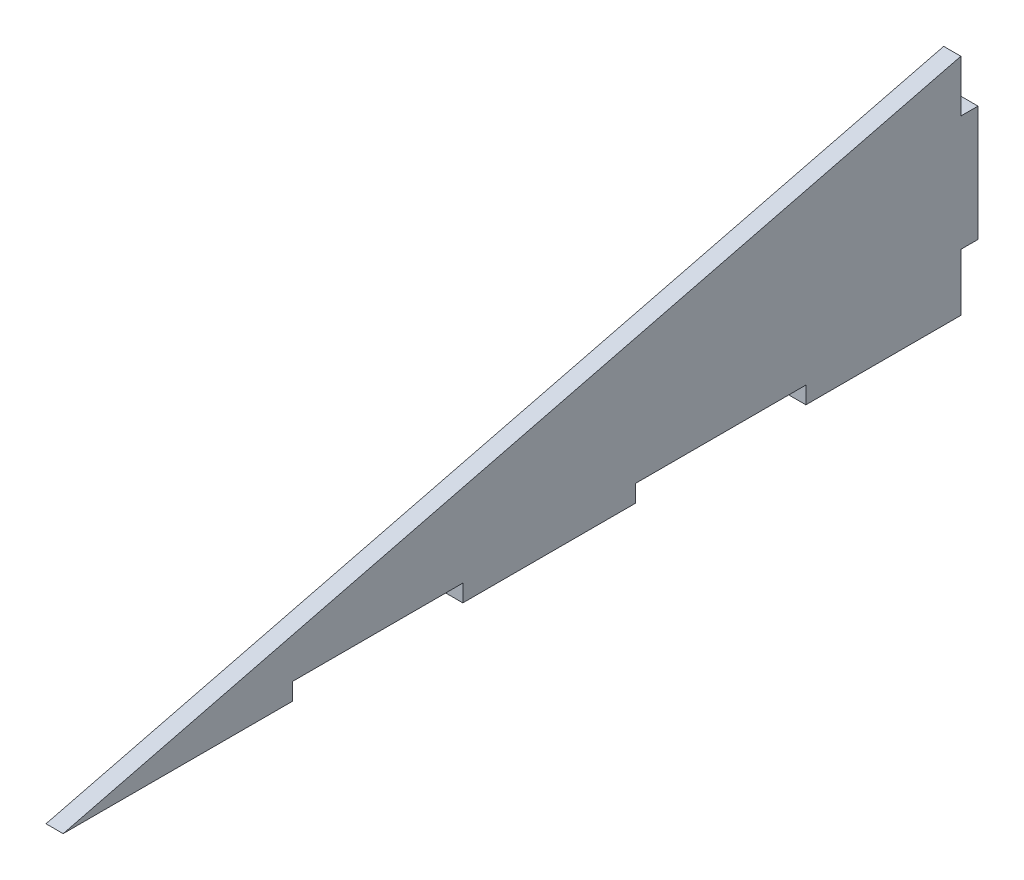
ISO-10303-21;
HEADER;
FILE_DESCRIPTION(('STEP AP214'),'2;1');
FILE_NAME('part.step','',(''),(''),'','','');
FILE_SCHEMA(('AUTOMOTIVE_DESIGN { 1 0 10303 214 1 1 1 1 }'));
ENDSEC;
DATA;
#1=APPLICATION_CONTEXT('core data for automotive mechanical design processes');
#2=APPLICATION_PROTOCOL_DEFINITION('international standard','automotive_design',2000,#1);
#3=PRODUCT_CONTEXT('',#1,'mechanical');
#4=PRODUCT('Part','Part','',(#3));
#5=PRODUCT_RELATED_PRODUCT_CATEGORY('part','',(#4));
#6=PRODUCT_DEFINITION_FORMATION('','',#4);
#7=PRODUCT_DEFINITION_CONTEXT('part definition',#1,'design');
#8=PRODUCT_DEFINITION('design','',#6,#7);
#9=PRODUCT_DEFINITION_SHAPE('','',#8);
#10=(LENGTH_UNIT() NAMED_UNIT(*) SI_UNIT(.MILLI.,.METRE.));
#11=(NAMED_UNIT(*) PLANE_ANGLE_UNIT() SI_UNIT($,.RADIAN.));
#12=(NAMED_UNIT(*) SI_UNIT($,.STERADIAN.) SOLID_ANGLE_UNIT());
#13=UNCERTAINTY_MEASURE_WITH_UNIT(LENGTH_MEASURE(1.E-05),#10,'distance_accuracy_value','');
#14=(GEOMETRIC_REPRESENTATION_CONTEXT(3) GLOBAL_UNCERTAINTY_ASSIGNED_CONTEXT((#13)) GLOBAL_UNIT_ASSIGNED_CONTEXT((#10,
#11,#12)) REPRESENTATION_CONTEXT('',''));
#15=CARTESIAN_POINT('',(0.,0.,0.));
#16=DIRECTION('',(0.,0.,1.));
#17=DIRECTION('',(1.,0.,0.));
#18=AXIS2_PLACEMENT_3D('',#15,#16,#17);
#19=CARTESIAN_POINT('',(3.,0.,-100.1));
#20=DIRECTION('',(0.,0.,1.));
#21=DIRECTION('',(1.,0.,0.));
#22=AXIS2_PLACEMENT_3D('',#19,#20,#21);
#23=PLANE('',#22);
#24=DIRECTION('',(0.,1.,0.));
#25=VECTOR('',#24,1.);
#26=CARTESIAN_POINT('',(0.,0.,-100.1));
#27=LINE('',#26,#25);
#28=CARTESIAN_POINT('',(0.,0.,-100.1));
#29=VERTEX_POINT('',#28);
#30=CARTESIAN_POINT('',(0.,3.,-100.1));
#31=VERTEX_POINT('',#30);
#32=EDGE_CURVE('E173',#29,#31,#27,.T.);
#33=ORIENTED_EDGE('',*,*,#32,.T.);
#34=DIRECTION('',(-1.,0.,0.));
#35=VECTOR('',#34,1.);
#36=CARTESIAN_POINT('',(3.,3.,-100.1));
#37=LINE('',#36,#35);
#38=CARTESIAN_POINT('',(3.,3.,-100.1));
#39=VERTEX_POINT('',#38);
#40=EDGE_CURVE('E11',#39,#31,#37,.T.);
#41=ORIENTED_EDGE('',*,*,#40,.F.);
#42=DIRECTION('',(0.,1.,0.));
#43=VECTOR('',#42,1.);
#44=CARTESIAN_POINT('',(3.,0.,-100.1));
#45=LINE('',#44,#43);
#46=CARTESIAN_POINT('',(3.,0.,-100.1));
#47=VERTEX_POINT('',#46);
#48=EDGE_CURVE('E251',#47,#39,#45,.T.);
#49=ORIENTED_EDGE('',*,*,#48,.F.);
#50=DIRECTION('',(-1.,0.,0.));
#51=VECTOR('',#50,1.);
#52=CARTESIAN_POINT('',(3.,0.,-100.1));
#53=LINE('',#52,#51);
#54=EDGE_CURVE('E167',#47,#29,#53,.T.);
#55=ORIENTED_EDGE('',*,*,#54,.T.);
#56=EDGE_LOOP('',(#33,#41,#49,#55));
#57=FACE_BOUND('',#56,.T.);
#58=ADVANCED_FACE('F34',(#57),#23,.F.);
#59=CARTESIAN_POINT('',(3.,3.,0.));
#60=DIRECTION('',(0.,1.,0.));
#61=DIRECTION('',(0.,0.,1.));
#62=AXIS2_PLACEMENT_3D('',#59,#60,#61);
#63=PLANE('',#62);
#64=DIRECTION('',(0.,0.,-1.));
#65=VECTOR('',#64,1.);
#66=CARTESIAN_POINT('',(0.,3.,0.));
#67=LINE('',#66,#65);
#68=CARTESIAN_POINT('',(0.,3.,-129.9));
#69=VERTEX_POINT('',#68);
#70=EDGE_CURVE('E176',#31,#69,#67,.T.);
#71=ORIENTED_EDGE('',*,*,#70,.T.);
#72=DIRECTION('',(-1.,0.,0.));
#73=VECTOR('',#72,1.);
#74=CARTESIAN_POINT('',(3.,3.,-129.9));
#75=LINE('',#74,#73);
#76=CARTESIAN_POINT('',(3.,3.,-129.9));
#77=VERTEX_POINT('',#76);
#78=EDGE_CURVE('E42',#77,#69,#75,.T.);
#79=ORIENTED_EDGE('',*,*,#78,.F.);
#80=DIRECTION('',(0.,0.,-1.));
#81=VECTOR('',#80,1.);
#82=CARTESIAN_POINT('',(3.,3.,0.));
#83=LINE('',#82,#81);
#84=EDGE_CURVE('E110',#39,#77,#83,.T.);
#85=ORIENTED_EDGE('',*,*,#84,.F.);
#86=ORIENTED_EDGE('',*,*,#40,.T.);
#87=EDGE_LOOP('',(#71,#79,#85,#86));
#88=FACE_BOUND('',#87,.T.);
#89=ADVANCED_FACE('F236',(#88),#63,.F.);
#90=CARTESIAN_POINT('',(3.,0.,-129.9));
#91=DIRECTION('',(0.,0.,1.));
#92=DIRECTION('',(1.,0.,0.));
#93=AXIS2_PLACEMENT_3D('',#90,#91,#92);
#94=PLANE('',#93);
#95=DIRECTION('',(0.,1.,0.));
#96=VECTOR('',#95,1.);
#97=CARTESIAN_POINT('',(0.,0.,-129.9));
#98=LINE('',#97,#96);
#99=CARTESIAN_POINT('',(0.,0.,-129.9));
#100=VERTEX_POINT('',#99);
#101=EDGE_CURVE('E179',#100,#69,#98,.T.);
#102=ORIENTED_EDGE('',*,*,#101,.F.);
#103=DIRECTION('',(-1.,0.,0.));
#104=VECTOR('',#103,1.);
#105=CARTESIAN_POINT('',(3.,0.,-129.9));
#106=LINE('',#105,#104);
#107=CARTESIAN_POINT('',(3.,0.,-129.9));
#108=VERTEX_POINT('',#107);
#109=EDGE_CURVE('E229',#108,#100,#106,.T.);
#110=ORIENTED_EDGE('',*,*,#109,.F.);
#111=DIRECTION('',(0.,1.,0.));
#112=VECTOR('',#111,1.);
#113=CARTESIAN_POINT('',(3.,0.,-129.9));
#114=LINE('',#113,#112);
#115=EDGE_CURVE('E235',#108,#77,#114,.T.);
#116=ORIENTED_EDGE('',*,*,#115,.T.);
#117=ORIENTED_EDGE('',*,*,#78,.T.);
#118=EDGE_LOOP('',(#102,#110,#116,#117));
#119=FACE_BOUND('',#118,.T.);
#120=ADVANCED_FACE('F233',(#119),#94,.T.);
#121=CARTESIAN_POINT('',(3.,0.,0.));
#122=DIRECTION('',(0.,1.,0.));
#123=DIRECTION('',(0.,0.,1.));
#124=AXIS2_PLACEMENT_3D('',#121,#122,#123);
#125=PLANE('',#124);
#126=DIRECTION('',(0.,0.,-1.));
#127=VECTOR('',#126,1.);
#128=CARTESIAN_POINT('',(0.,0.,0.));
#129=LINE('',#128,#127);
#130=CARTESIAN_POINT('',(0.,0.,-157.));
#131=VERTEX_POINT('',#130);
#132=EDGE_CURVE('E182',#100,#131,#129,.T.);
#133=ORIENTED_EDGE('',*,*,#132,.T.);
#134=DIRECTION('',(-1.,0.,0.));
#135=VECTOR('',#134,1.);
#136=CARTESIAN_POINT('',(3.,0.,-157.));
#137=LINE('',#136,#135);
#138=CARTESIAN_POINT('',(3.,0.,-157.));
#139=VERTEX_POINT('',#138);
#140=EDGE_CURVE('E227',#139,#131,#137,.T.);
#141=ORIENTED_EDGE('',*,*,#140,.F.);
#142=DIRECTION('',(0.,0.,-1.));
#143=VECTOR('',#142,1.);
#144=CARTESIAN_POINT('',(3.,0.,0.));
#145=LINE('',#144,#143);
#146=EDGE_CURVE('E170',#108,#139,#145,.T.);
#147=ORIENTED_EDGE('',*,*,#146,.F.);
#148=ORIENTED_EDGE('',*,*,#109,.T.);
#149=EDGE_LOOP('',(#133,#141,#147,#148));
#150=FACE_BOUND('',#149,.T.);
#151=ADVANCED_FACE('F245',(#150),#125,.F.);
#152=CARTESIAN_POINT('',(3.,0.,-157.));
#153=DIRECTION('',(0.,0.,-1.));
#154=DIRECTION('',(-1.,0.,0.));
#155=AXIS2_PLACEMENT_3D('',#152,#153,#154);
#156=PLANE('',#155);
#157=DIRECTION('',(0.,-1.,0.));
#158=VECTOR('',#157,1.);
#159=CARTESIAN_POINT('',(0.,0.,-157.));
#160=LINE('',#159,#158);
#161=CARTESIAN_POINT('',(0.,10.,-157.));
#162=VERTEX_POINT('',#161);
#163=EDGE_CURVE('E185',#162,#131,#160,.T.);
#164=ORIENTED_EDGE('',*,*,#163,.F.);
#165=DIRECTION('',(-1.,0.,0.));
#166=VECTOR('',#165,1.);
#167=CARTESIAN_POINT('',(3.,10.,-157.));
#168=LINE('',#167,#166);
#169=CARTESIAN_POINT('',(3.,10.,-157.));
#170=VERTEX_POINT('',#169);
#171=EDGE_CURVE('E225',#170,#162,#168,.T.);
#172=ORIENTED_EDGE('',*,*,#171,.F.);
#173=DIRECTION('',(0.,-1.,0.));
#174=VECTOR('',#173,1.);
#175=CARTESIAN_POINT('',(3.,0.,-157.));
#176=LINE('',#175,#174);
#177=EDGE_CURVE('E249',#170,#139,#176,.T.);
#178=ORIENTED_EDGE('',*,*,#177,.T.);
#179=ORIENTED_EDGE('',*,*,#140,.T.);
#180=EDGE_LOOP('',(#164,#172,#178,#179));
#181=FACE_BOUND('',#180,.T.);
#182=ADVANCED_FACE('F289',(#181),#156,.T.);
#183=CARTESIAN_POINT('',(3.,10.0000000000001,0.));
#184=DIRECTION('',(0.,-1.,0.));
#185=DIRECTION('',(0.,0.,-1.));
#186=AXIS2_PLACEMENT_3D('',#183,#184,#185);
#187=PLANE('',#186);
#188=DIRECTION('',(0.,0.,1.));
#189=VECTOR('',#188,1.);
#190=CARTESIAN_POINT('',(0.,10.0000000000001,0.));
#191=LINE('',#190,#189);
#192=CARTESIAN_POINT('',(0.,10.,-160.));
#193=VERTEX_POINT('',#192);
#194=EDGE_CURVE('E189',#193,#162,#191,.T.);
#195=ORIENTED_EDGE('',*,*,#194,.F.);
#196=DIRECTION('',(-1.,0.,0.));
#197=VECTOR('',#196,1.);
#198=CARTESIAN_POINT('',(3.,10.,-160.));
#199=LINE('',#198,#197);
#200=CARTESIAN_POINT('',(3.,10.,-160.));
#201=VERTEX_POINT('',#200);
#202=EDGE_CURVE('E223',#201,#193,#199,.T.);
#203=ORIENTED_EDGE('',*,*,#202,.F.);
#204=DIRECTION('',(0.,0.,1.));
#205=VECTOR('',#204,1.);
#206=CARTESIAN_POINT('',(3.,10.0000000000001,0.));
#207=LINE('',#206,#205);
#208=EDGE_CURVE('E256',#201,#170,#207,.T.);
#209=ORIENTED_EDGE('',*,*,#208,.T.);
#210=ORIENTED_EDGE('',*,*,#171,.T.);
#211=EDGE_LOOP('',(#195,#203,#209,#210));
#212=FACE_BOUND('',#211,.T.);
#213=ADVANCED_FACE('F303',(#212),#187,.T.);
#214=CARTESIAN_POINT('',(3.,0.,-160.));
#215=DIRECTION('',(0.,0.,1.));
#216=DIRECTION('',(1.,0.,0.));
#217=AXIS2_PLACEMENT_3D('',#214,#215,#216);
#218=PLANE('',#217);
#219=DIRECTION('',(0.,1.,0.));
#220=VECTOR('',#219,1.);
#221=CARTESIAN_POINT('',(0.,0.,-160.));
#222=LINE('',#221,#220);
#223=CARTESIAN_POINT('',(0.,30.2,-160.));
#224=VERTEX_POINT('',#223);
#225=EDGE_CURVE('E192',#193,#224,#222,.T.);
#226=ORIENTED_EDGE('',*,*,#225,.T.);
#227=DIRECTION('',(-1.,0.,0.));
#228=VECTOR('',#227,1.);
#229=CARTESIAN_POINT('',(3.,30.2,-160.));
#230=LINE('',#229,#228);
#231=CARTESIAN_POINT('',(3.,30.2,-160.));
#232=VERTEX_POINT('',#231);
#233=EDGE_CURVE('E220',#232,#224,#230,.T.);
#234=ORIENTED_EDGE('',*,*,#233,.F.);
#235=DIRECTION('',(0.,1.,0.));
#236=VECTOR('',#235,1.);
#237=CARTESIAN_POINT('',(3.,0.,-160.));
#238=LINE('',#237,#236);
#239=EDGE_CURVE('E259',#201,#232,#238,.T.);
#240=ORIENTED_EDGE('',*,*,#239,.F.);
#241=ORIENTED_EDGE('',*,*,#202,.T.);
#242=EDGE_LOOP('',(#226,#234,#240,#241));
#243=FACE_BOUND('',#242,.T.);
#244=ADVANCED_FACE('F307',(#243),#218,.F.);
#245=CARTESIAN_POINT('',(3.,30.2,0.));
#246=DIRECTION('',(0.,-1.,0.));
#247=DIRECTION('',(0.,0.,-1.));
#248=AXIS2_PLACEMENT_3D('',#245,#246,#247);
#249=PLANE('',#248);
#250=DIRECTION('',(0.,0.,1.));
#251=VECTOR('',#250,1.);
#252=CARTESIAN_POINT('',(0.,30.2,0.));
#253=LINE('',#252,#251);
#254=CARTESIAN_POINT('',(0.,30.2,-157.));
#255=VERTEX_POINT('',#254);
#256=EDGE_CURVE('E194',#224,#255,#253,.T.);
#257=ORIENTED_EDGE('',*,*,#256,.T.);
#258=DIRECTION('',(-1.,0.,0.));
#259=VECTOR('',#258,1.);
#260=CARTESIAN_POINT('',(3.,30.2,-157.));
#261=LINE('',#260,#259);
#262=CARTESIAN_POINT('',(3.,30.2,-157.));
#263=VERTEX_POINT('',#262);
#264=EDGE_CURVE('E217',#263,#255,#261,.T.);
#265=ORIENTED_EDGE('',*,*,#264,.F.);
#266=DIRECTION('',(0.,0.,1.));
#267=VECTOR('',#266,1.);
#268=CARTESIAN_POINT('',(3.,30.2,0.));
#269=LINE('',#268,#267);
#270=EDGE_CURVE('E261',#232,#263,#269,.T.);
#271=ORIENTED_EDGE('',*,*,#270,.F.);
#272=ORIENTED_EDGE('',*,*,#233,.T.);
#273=EDGE_LOOP('',(#257,#265,#271,#272));
#274=FACE_BOUND('',#273,.T.);
#275=ADVANCED_FACE('F311',(#274),#249,.F.);
#276=CARTESIAN_POINT('',(3.,4.8150556592859E-13,-157.));
#277=DIRECTION('',(0.,0.,1.));
#278=DIRECTION('',(0.,-1.,0.));
#279=AXIS2_PLACEMENT_3D('',#276,#277,#278);
#280=PLANE('',#279);
#281=DIRECTION('',(0.,1.,0.));
#282=VECTOR('',#281,1.);
#283=CARTESIAN_POINT('',(0.,4.8150556592859E-13,-157.));
#284=LINE('',#283,#282);
#285=CARTESIAN_POINT('',(0.,39.25,-157.));
#286=VERTEX_POINT('',#285);
#287=EDGE_CURVE('E196',#255,#286,#284,.T.);
#288=ORIENTED_EDGE('',*,*,#287,.T.);
#289=DIRECTION('',(-1.,0.,0.));
#290=VECTOR('',#289,1.);
#291=CARTESIAN_POINT('',(3.,39.25,-157.));
#292=LINE('',#291,#290);
#293=CARTESIAN_POINT('',(3.,39.25,-157.));
#294=VERTEX_POINT('',#293);
#295=EDGE_CURVE('E215',#294,#286,#292,.T.);
#296=ORIENTED_EDGE('',*,*,#295,.F.);
#297=DIRECTION('',(0.,1.,0.));
#298=VECTOR('',#297,1.);
#299=CARTESIAN_POINT('',(3.,4.8150556592859E-13,-157.));
#300=LINE('',#299,#298);
#301=EDGE_CURVE('E263',#263,#294,#300,.T.);
#302=ORIENTED_EDGE('',*,*,#301,.F.);
#303=ORIENTED_EDGE('',*,*,#264,.T.);
#304=EDGE_LOOP('',(#288,#296,#302,#303));
#305=FACE_BOUND('',#304,.T.);
#306=ADVANCED_FACE('F315',(#305),#280,.F.);
#307=CARTESIAN_POINT('',(3.,0.,0.));
#308=DIRECTION('',(0.,0.970142500145332,0.242535625036333));
#309=DIRECTION('',(0.,-0.242535625036333,0.970142500145332));
#310=AXIS2_PLACEMENT_3D('',#307,#308,#309);
#311=PLANE('',#310);
#312=DIRECTION('',(0.,0.242535625036333,-0.970142500145332));
#313=VECTOR('',#312,1.);
#314=CARTESIAN_POINT('',(0.,0.,0.));
#315=LINE('',#314,#313);
#316=CARTESIAN_POINT('',(0.,0.,0.));
#317=VERTEX_POINT('',#316);
#318=EDGE_CURVE('E199',#317,#286,#315,.T.);
#319=ORIENTED_EDGE('',*,*,#318,.F.);
#320=DIRECTION('',(-1.,0.,0.));
#321=VECTOR('',#320,1.);
#322=CARTESIAN_POINT('',(3.,0.,0.));
#323=LINE('',#322,#321);
#324=CARTESIAN_POINT('',(3.,0.,0.));
#325=VERTEX_POINT('',#324);
#326=EDGE_CURVE('E213',#325,#317,#323,.T.);
#327=ORIENTED_EDGE('',*,*,#326,.F.);
#328=DIRECTION('',(0.,0.242535625036333,-0.970142500145332));
#329=VECTOR('',#328,1.);
#330=CARTESIAN_POINT('',(3.,0.,0.));
#331=LINE('',#330,#329);
#332=EDGE_CURVE('E265',#325,#294,#331,.T.);
#333=ORIENTED_EDGE('',*,*,#332,.T.);
#334=ORIENTED_EDGE('',*,*,#295,.T.);
#335=EDGE_LOOP('',(#319,#327,#333,#334));
#336=FACE_BOUND('',#335,.T.);
#337=ADVANCED_FACE('F291',(#336),#311,.T.);
#338=CARTESIAN_POINT('',(0.,0.,-40.1));
#339=VERTEX_POINT('',#338);
#340=EDGE_CURVE('E186',#317,#339,#129,.T.);
#341=ORIENTED_EDGE('',*,*,#340,.T.);
#342=DIRECTION('',(-1.,0.,0.));
#343=VECTOR('',#342,1.);
#344=CARTESIAN_POINT('',(3.,0.,-40.1));
#345=LINE('',#344,#343);
#346=CARTESIAN_POINT('',(3.,0.,-40.1));
#347=VERTEX_POINT('',#346);
#348=EDGE_CURVE('E210',#347,#339,#345,.T.);
#349=ORIENTED_EDGE('',*,*,#348,.F.);
#350=EDGE_CURVE('E169',#325,#347,#145,.T.);
#351=ORIENTED_EDGE('',*,*,#350,.F.);
#352=ORIENTED_EDGE('',*,*,#326,.T.);
#353=EDGE_LOOP('',(#341,#349,#351,#352));
#354=FACE_BOUND('',#353,.T.);
#355=ADVANCED_FACE('F271',(#354),#125,.F.);
#356=CARTESIAN_POINT('',(3.,0.,-40.1));
#357=DIRECTION('',(0.,0.,1.));
#358=DIRECTION('',(1.,0.,0.));
#359=AXIS2_PLACEMENT_3D('',#356,#357,#358);
#360=PLANE('',#359);
#361=DIRECTION('',(0.,1.,0.));
#362=VECTOR('',#361,1.);
#363=CARTESIAN_POINT('',(0.,0.,-40.1));
#364=LINE('',#363,#362);
#365=CARTESIAN_POINT('',(0.,3.,-40.1));
#366=VERTEX_POINT('',#365);
#367=EDGE_CURVE('E202',#339,#366,#364,.T.);
#368=ORIENTED_EDGE('',*,*,#367,.T.);
#369=DIRECTION('',(-1.,0.,0.));
#370=VECTOR('',#369,1.);
#371=CARTESIAN_POINT('',(3.,3.,-40.1));
#372=LINE('',#371,#370);
#373=CARTESIAN_POINT('',(3.,3.,-40.1));
#374=VERTEX_POINT('',#373);
#375=EDGE_CURVE('E163',#374,#366,#372,.T.);
#376=ORIENTED_EDGE('',*,*,#375,.F.);
#377=DIRECTION('',(0.,1.,0.));
#378=VECTOR('',#377,1.);
#379=CARTESIAN_POINT('',(3.,0.,-40.1));
#380=LINE('',#379,#378);
#381=EDGE_CURVE('E150',#347,#374,#380,.T.);
#382=ORIENTED_EDGE('',*,*,#381,.F.);
#383=ORIENTED_EDGE('',*,*,#348,.T.);
#384=EDGE_LOOP('',(#368,#376,#382,#383));
#385=FACE_BOUND('',#384,.T.);
#386=ADVANCED_FACE('F275',(#385),#360,.F.);
#387=CARTESIAN_POINT('',(3.,3.,0.));
#388=DIRECTION('',(0.,1.,0.));
#389=DIRECTION('',(0.,0.,1.));
#390=AXIS2_PLACEMENT_3D('',#387,#388,#389);
#391=PLANE('',#390);
#392=DIRECTION('',(0.,0.,-1.));
#393=VECTOR('',#392,1.);
#394=CARTESIAN_POINT('',(0.,3.,0.));
#395=LINE('',#394,#393);
#396=CARTESIAN_POINT('',(0.,3.,-69.9));
#397=VERTEX_POINT('',#396);
#398=EDGE_CURVE('E159',#366,#397,#395,.T.);
#399=ORIENTED_EDGE('',*,*,#398,.T.);
#400=DIRECTION('',(-1.,0.,0.));
#401=VECTOR('',#400,1.);
#402=CARTESIAN_POINT('',(3.,3.,-69.9));
#403=LINE('',#402,#401);
#404=CARTESIAN_POINT('',(3.,3.,-69.9));
#405=VERTEX_POINT('',#404);
#406=EDGE_CURVE('E156',#405,#397,#403,.T.);
#407=ORIENTED_EDGE('',*,*,#406,.F.);
#408=DIRECTION('',(0.,0.,-1.));
#409=VECTOR('',#408,1.);
#410=CARTESIAN_POINT('',(3.,3.,0.));
#411=LINE('',#410,#409);
#412=EDGE_CURVE('E144',#374,#405,#411,.T.);
#413=ORIENTED_EDGE('',*,*,#412,.F.);
#414=ORIENTED_EDGE('',*,*,#375,.T.);
#415=EDGE_LOOP('',(#399,#407,#413,#414));
#416=FACE_BOUND('',#415,.T.);
#417=ADVANCED_FACE('F157',(#416),#391,.F.);
#418=CARTESIAN_POINT('',(3.,0.,-69.9));
#419=DIRECTION('',(0.,0.,1.));
#420=DIRECTION('',(1.,0.,0.));
#421=AXIS2_PLACEMENT_3D('',#418,#419,#420);
#422=PLANE('',#421);
#423=DIRECTION('',(0.,1.,0.));
#424=VECTOR('',#423,1.);
#425=CARTESIAN_POINT('',(0.,0.,-69.9));
#426=LINE('',#425,#424);
#427=CARTESIAN_POINT('',(0.,0.,-69.9));
#428=VERTEX_POINT('',#427);
#429=EDGE_CURVE('E205',#428,#397,#426,.T.);
#430=ORIENTED_EDGE('',*,*,#429,.F.);
#431=DIRECTION('',(-1.,0.,0.));
#432=VECTOR('',#431,1.);
#433=CARTESIAN_POINT('',(3.,0.,-69.9));
#434=LINE('',#433,#432);
#435=CARTESIAN_POINT('',(3.,0.,-69.9));
#436=VERTEX_POINT('',#435);
#437=EDGE_CURVE('E99',#436,#428,#434,.T.);
#438=ORIENTED_EDGE('',*,*,#437,.F.);
#439=DIRECTION('',(0.,1.,0.));
#440=VECTOR('',#439,1.);
#441=CARTESIAN_POINT('',(3.,0.,-69.9));
#442=LINE('',#441,#440);
#443=EDGE_CURVE('E148',#436,#405,#442,.T.);
#444=ORIENTED_EDGE('',*,*,#443,.T.);
#445=ORIENTED_EDGE('',*,*,#406,.T.);
#446=EDGE_LOOP('',(#430,#438,#444,#445));
#447=FACE_BOUND('',#446,.T.);
#448=ADVANCED_FACE('F165',(#447),#422,.T.);
#449=EDGE_CURVE('E102',#428,#29,#129,.T.);
#450=ORIENTED_EDGE('',*,*,#449,.T.);
#451=ORIENTED_EDGE('',*,*,#54,.F.);
#452=EDGE_CURVE('E50',#436,#47,#145,.T.);
#453=ORIENTED_EDGE('',*,*,#452,.F.);
#454=ORIENTED_EDGE('',*,*,#437,.T.);
#455=EDGE_LOOP('',(#450,#451,#453,#454));
#456=FACE_BOUND('',#455,.T.);
#457=ADVANCED_FACE('F278',(#456),#125,.F.);
#458=CARTESIAN_POINT('',(3.,0.,0.));
#459=DIRECTION('',(1.,0.,0.));
#460=DIRECTION('',(0.,0.,-1.));
#461=AXIS2_PLACEMENT_3D('',#458,#459,#460);
#462=PLANE('',#461);
#463=ORIENTED_EDGE('',*,*,#48,.T.);
#464=ORIENTED_EDGE('',*,*,#84,.T.);
#465=ORIENTED_EDGE('',*,*,#115,.F.);
#466=ORIENTED_EDGE('',*,*,#146,.T.);
#467=ORIENTED_EDGE('',*,*,#177,.F.);
#468=ORIENTED_EDGE('',*,*,#208,.F.);
#469=ORIENTED_EDGE('',*,*,#239,.T.);
#470=ORIENTED_EDGE('',*,*,#270,.T.);
#471=ORIENTED_EDGE('',*,*,#301,.T.);
#472=ORIENTED_EDGE('',*,*,#332,.F.);
#473=ORIENTED_EDGE('',*,*,#350,.T.);
#474=ORIENTED_EDGE('',*,*,#381,.T.);
#475=ORIENTED_EDGE('',*,*,#412,.T.);
#476=ORIENTED_EDGE('',*,*,#443,.F.);
#477=ORIENTED_EDGE('',*,*,#452,.T.);
#478=EDGE_LOOP('',(#463,#464,#465,#466,#467,#468,#469,#470,#471,#472,#473,#474,#475,#476,#477));
#479=FACE_BOUND('',#478,.T.);
#480=ADVANCED_FACE('F146',(#479),#462,.T.);
#481=CARTESIAN_POINT('',(0.,0.,0.));
#482=DIRECTION('',(1.,0.,0.));
#483=DIRECTION('',(0.,0.,-1.));
#484=AXIS2_PLACEMENT_3D('',#481,#482,#483);
#485=PLANE('',#484);
#486=ORIENTED_EDGE('',*,*,#32,.F.);
#487=ORIENTED_EDGE('',*,*,#449,.F.);
#488=ORIENTED_EDGE('',*,*,#429,.T.);
#489=ORIENTED_EDGE('',*,*,#398,.F.);
#490=ORIENTED_EDGE('',*,*,#367,.F.);
#491=ORIENTED_EDGE('',*,*,#340,.F.);
#492=ORIENTED_EDGE('',*,*,#318,.T.);
#493=ORIENTED_EDGE('',*,*,#287,.F.);
#494=ORIENTED_EDGE('',*,*,#256,.F.);
#495=ORIENTED_EDGE('',*,*,#225,.F.);
#496=ORIENTED_EDGE('',*,*,#194,.T.);
#497=ORIENTED_EDGE('',*,*,#163,.T.);
#498=ORIENTED_EDGE('',*,*,#132,.F.);
#499=ORIENTED_EDGE('',*,*,#101,.T.);
#500=ORIENTED_EDGE('',*,*,#70,.F.);
#501=EDGE_LOOP('',(#486,#487,#488,#489,#490,#491,#492,#493,#494,#495,#496,#497,#498,#499,#500));
#502=FACE_BOUND('',#501,.T.);
#503=ADVANCED_FACE('F241',(#502),#485,.F.);
#504=CLOSED_SHELL('',(#58,#89,#120,#151,#182,#213,#244,#275,#306,#337,#355,#386,#417,#448,#457,
#480,#503));
#505=MANIFOLD_SOLID_BREP('B2',#504);
#506=ADVANCED_BREP_SHAPE_REPRESENTATION('',(#18,#505),#14);
#507=SHAPE_DEFINITION_REPRESENTATION(#9,#506);
ENDSEC;
END-ISO-10303-21;
